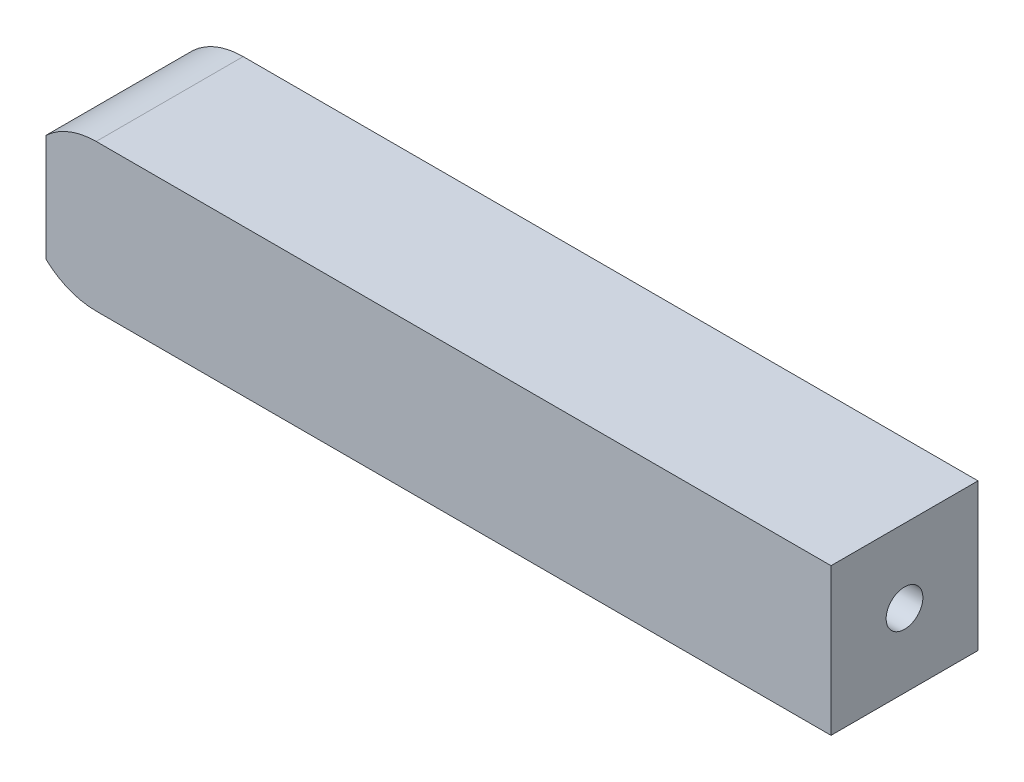
ISO-10303-21;
HEADER;
FILE_DESCRIPTION(('STEP AP214'),'2;1');
FILE_NAME('part.step','',(''),(''),'','','');
FILE_SCHEMA(('AUTOMOTIVE_DESIGN { 1 0 10303 214 1 1 1 1 }'));
ENDSEC;
DATA;
#1=APPLICATION_CONTEXT('core data for automotive mechanical design processes');
#2=APPLICATION_PROTOCOL_DEFINITION('international standard','automotive_design',2000,#1);
#3=PRODUCT_CONTEXT('',#1,'mechanical');
#4=PRODUCT('Part','Part','',(#3));
#5=PRODUCT_RELATED_PRODUCT_CATEGORY('part','',(#4));
#6=PRODUCT_DEFINITION_FORMATION('','',#4);
#7=PRODUCT_DEFINITION_CONTEXT('part definition',#1,'design');
#8=PRODUCT_DEFINITION('design','',#6,#7);
#9=PRODUCT_DEFINITION_SHAPE('','',#8);
#10=(LENGTH_UNIT() NAMED_UNIT(*) SI_UNIT(.MILLI.,.METRE.));
#11=(NAMED_UNIT(*) PLANE_ANGLE_UNIT() SI_UNIT($,.RADIAN.));
#12=(NAMED_UNIT(*) SI_UNIT($,.STERADIAN.) SOLID_ANGLE_UNIT());
#13=UNCERTAINTY_MEASURE_WITH_UNIT(LENGTH_MEASURE(1.E-05),#10,'distance_accuracy_value','');
#14=(GEOMETRIC_REPRESENTATION_CONTEXT(3) GLOBAL_UNCERTAINTY_ASSIGNED_CONTEXT((#13)) GLOBAL_UNIT_ASSIGNED_CONTEXT((#10,
#11,#12)) REPRESENTATION_CONTEXT('',''));
#15=CARTESIAN_POINT('',(0.,0.,0.));
#16=DIRECTION('',(0.,0.,1.));
#17=DIRECTION('',(1.,0.,0.));
#18=AXIS2_PLACEMENT_3D('',#15,#16,#17);
#19=CARTESIAN_POINT('',(0.,0.,-4.));
#20=DIRECTION('',(0.,0.,1.));
#21=DIRECTION('',(-1.,0.,0.));
#22=AXIS2_PLACEMENT_3D('',#19,#20,#21);
#23=CYLINDRICAL_SURFACE('',#22,2.);
#24=DIRECTION('',(0.,0.,-1.));
#25=VECTOR('',#24,1.);
#26=CARTESIAN_POINT('',(-1.36602540378444,-1.46081299152751,-1.));
#27=LINE('',#26,#25);
#28=CARTESIAN_POINT('',(-1.36602540378444,-1.46081299152751,0.));
#29=VERTEX_POINT('',#28);
#30=CARTESIAN_POINT('',(-1.36602540378444,-1.46081299152751,-4.));
#31=VERTEX_POINT('',#30);
#32=EDGE_CURVE('E213',#29,#31,#27,.T.);
#33=ORIENTED_EDGE('',*,*,#32,.T.);
#34=CARTESIAN_POINT('',(0.,0.,-4.));
#35=DIRECTION('',(0.,0.,1.));
#36=DIRECTION('',(1.,0.,0.));
#37=AXIS2_PLACEMENT_3D('',#34,#35,#36);
#38=CIRCLE('',#37,2.);
#39=CARTESIAN_POINT('',(0.,-2.,-4.));
#40=VERTEX_POINT('',#39);
#41=EDGE_CURVE('E248',#31,#40,#38,.T.);
#42=ORIENTED_EDGE('',*,*,#41,.T.);
#43=DIRECTION('',(0.,0.,1.));
#44=VECTOR('',#43,1.);
#45=CARTESIAN_POINT('',(0.,-2.,-4.));
#46=LINE('',#45,#44);
#47=CARTESIAN_POINT('',(0.,-2.,0.));
#48=VERTEX_POINT('',#47);
#49=EDGE_CURVE('E274',#40,#48,#46,.T.);
#50=ORIENTED_EDGE('',*,*,#49,.T.);
#51=CARTESIAN_POINT('',(0.,0.,0.));
#52=DIRECTION('',(0.,0.,1.));
#53=DIRECTION('',(1.,0.,0.));
#54=AXIS2_PLACEMENT_3D('',#51,#52,#53);
#55=CIRCLE('',#54,2.);
#56=EDGE_CURVE('E262',#29,#48,#55,.T.);
#57=ORIENTED_EDGE('',*,*,#56,.F.);
#58=EDGE_LOOP('',(#33,#42,#50,#57));
#59=FACE_BOUND('',#58,.T.);
#60=ADVANCED_FACE('F39',(#59),#23,.T.);
#61=CARTESIAN_POINT('',(0.,2.,-4.));
#62=DIRECTION('',(0.,-1.,0.));
#63=DIRECTION('',(0.,0.,1.));
#64=AXIS2_PLACEMENT_3D('',#61,#62,#63);
#65=PLANE('',#64);
#66=DIRECTION('',(-1.,0.,0.));
#67=VECTOR('',#66,1.);
#68=CARTESIAN_POINT('',(0.,2.,0.));
#69=LINE('',#68,#67);
#70=CARTESIAN_POINT('',(20.,2.,0.));
#71=VERTEX_POINT('',#70);
#72=CARTESIAN_POINT('',(0.,2.,0.));
#73=VERTEX_POINT('',#72);
#74=EDGE_CURVE('E242',#71,#73,#69,.T.);
#75=ORIENTED_EDGE('',*,*,#74,.F.);
#76=DIRECTION('',(0.,0.,1.));
#77=VECTOR('',#76,1.);
#78=CARTESIAN_POINT('',(20.,2.,-4.));
#79=LINE('',#78,#77);
#80=CARTESIAN_POINT('',(20.,2.,-4.));
#81=VERTEX_POINT('',#80);
#82=EDGE_CURVE('E259',#81,#71,#79,.T.);
#83=ORIENTED_EDGE('',*,*,#82,.F.);
#84=DIRECTION('',(-1.,0.,0.));
#85=VECTOR('',#84,1.);
#86=CARTESIAN_POINT('',(0.,2.,-4.));
#87=LINE('',#86,#85);
#88=CARTESIAN_POINT('',(0.,2.,-4.));
#89=VERTEX_POINT('',#88);
#90=EDGE_CURVE('E245',#81,#89,#87,.T.);
#91=ORIENTED_EDGE('',*,*,#90,.T.);
#92=DIRECTION('',(0.,0.,1.));
#93=VECTOR('',#92,1.);
#94=CARTESIAN_POINT('',(0.,2.,-4.));
#95=LINE('',#94,#93);
#96=EDGE_CURVE('E47',#89,#73,#95,.T.);
#97=ORIENTED_EDGE('',*,*,#96,.T.);
#98=EDGE_LOOP('',(#75,#83,#91,#97));
#99=FACE_BOUND('',#98,.T.);
#100=ADVANCED_FACE('F41',(#99),#65,.F.);
#101=CARTESIAN_POINT('',(-1.36602540378444,1.46081299152751,0.));
#102=VERTEX_POINT('',#101);
#103=EDGE_CURVE('E263',#73,#102,#55,.T.);
#104=ORIENTED_EDGE('',*,*,#103,.F.);
#105=ORIENTED_EDGE('',*,*,#96,.F.);
#106=CARTESIAN_POINT('',(-1.36602540378444,1.46081299152751,-4.));
#107=VERTEX_POINT('',#106);
#108=EDGE_CURVE('E250',#89,#107,#38,.T.);
#109=ORIENTED_EDGE('',*,*,#108,.T.);
#110=DIRECTION('',(0.,0.,-1.));
#111=VECTOR('',#110,1.);
#112=CARTESIAN_POINT('',(-1.36602540378444,1.46081299152751,-1.));
#113=LINE('',#112,#111);
#114=EDGE_CURVE('E225',#102,#107,#113,.T.);
#115=ORIENTED_EDGE('',*,*,#114,.F.);
#116=EDGE_LOOP('',(#104,#105,#109,#115));
#117=FACE_BOUND('',#116,.T.);
#118=ADVANCED_FACE('F295',(#117),#23,.T.);
#119=CARTESIAN_POINT('',(0.,-2.,-4.));
#120=DIRECTION('',(0.,-1.,0.));
#121=DIRECTION('',(0.,0.,1.));
#122=AXIS2_PLACEMENT_3D('',#119,#120,#121);
#123=PLANE('',#122);
#124=DIRECTION('',(0.,0.,-1.));
#125=VECTOR('',#124,1.);
#126=CARTESIAN_POINT('',(11.6190832105267,-2.,-1.));
#127=LINE('',#126,#125);
#128=CARTESIAN_POINT('',(11.6190832105267,-2.,-1.));
#129=VERTEX_POINT('',#128);
#130=CARTESIAN_POINT('',(11.6190832105267,-2.,-4.));
#131=VERTEX_POINT('',#130);
#132=EDGE_CURVE('E198',#129,#131,#127,.T.);
#133=ORIENTED_EDGE('',*,*,#132,.T.);
#134=DIRECTION('',(-1.,0.,0.));
#135=VECTOR('',#134,1.);
#136=CARTESIAN_POINT('',(0.,-2.,-4.));
#137=LINE('',#136,#135);
#138=CARTESIAN_POINT('',(20.,-2.,-4.));
#139=VERTEX_POINT('',#138);
#140=EDGE_CURVE('E254',#139,#131,#137,.T.);
#141=ORIENTED_EDGE('',*,*,#140,.F.);
#142=DIRECTION('',(0.,0.,1.));
#143=VECTOR('',#142,1.);
#144=CARTESIAN_POINT('',(20.,-2.,-4.));
#145=LINE('',#144,#143);
#146=CARTESIAN_POINT('',(20.,-2.,0.));
#147=VERTEX_POINT('',#146);
#148=EDGE_CURVE('E271',#139,#147,#145,.T.);
#149=ORIENTED_EDGE('',*,*,#148,.T.);
#150=DIRECTION('',(-1.,0.,0.));
#151=VECTOR('',#150,1.);
#152=CARTESIAN_POINT('',(0.,-2.,0.));
#153=LINE('',#152,#151);
#154=EDGE_CURVE('E266',#147,#48,#153,.T.);
#155=ORIENTED_EDGE('',*,*,#154,.T.);
#156=ORIENTED_EDGE('',*,*,#49,.F.);
#157=CARTESIAN_POINT('',(8.82827307928189,-2.,-4.));
#158=VERTEX_POINT('',#157);
#159=EDGE_CURVE('E253',#158,#40,#137,.T.);
#160=ORIENTED_EDGE('',*,*,#159,.F.);
#161=DIRECTION('',(0.,0.,-1.));
#162=VECTOR('',#161,1.);
#163=CARTESIAN_POINT('',(8.82827307928189,-2.,-1.));
#164=LINE('',#163,#162);
#165=CARTESIAN_POINT('',(8.82827307928189,-2.,-1.));
#166=VERTEX_POINT('',#165);
#167=EDGE_CURVE('E201',#166,#158,#164,.T.);
#168=ORIENTED_EDGE('',*,*,#167,.F.);
#169=DIRECTION('',(1.,0.,0.));
#170=VECTOR('',#169,1.);
#171=CARTESIAN_POINT('',(9.91748930079195,-2.,-1.));
#172=LINE('',#171,#170);
#173=EDGE_CURVE('E181',#166,#129,#172,.T.);
#174=ORIENTED_EDGE('',*,*,#173,.T.);
#175=EDGE_LOOP('',(#133,#141,#149,#155,#156,#160,#168,#174));
#176=FACE_BOUND('',#175,.T.);
#177=ADVANCED_FACE('F304',(#176),#123,.T.);
#178=CARTESIAN_POINT('',(20.,0.,-4.));
#179=DIRECTION('',(-1.,0.,0.));
#180=DIRECTION('',(0.,0.,-1.));
#181=AXIS2_PLACEMENT_3D('',#178,#179,#180);
#182=PLANE('',#181);
#183=CARTESIAN_POINT('',(20.,0.,-2.00000000000477));
#184=DIRECTION('',(-1.,0.,0.));
#185=DIRECTION('',(0.,0.,1.));
#186=AXIS2_PLACEMENT_3D('',#183,#184,#185);
#187=CIRCLE('',#186,0.5);
#188=CARTESIAN_POINT('',(20.,0.,-1.50000000000477));
#189=VERTEX_POINT('',#188);
#190=EDGE_CURVE('E228',#189,#189,#187,.T.);
#191=ORIENTED_EDGE('',*,*,#190,.T.);
#192=EDGE_LOOP('',(#191));
#193=FACE_BOUND('',#192,.T.);
#194=DIRECTION('',(0.,1.,0.));
#195=VECTOR('',#194,1.);
#196=CARTESIAN_POINT('',(20.,0.,0.));
#197=LINE('',#196,#195);
#198=EDGE_CURVE('E249',#147,#71,#197,.T.);
#199=ORIENTED_EDGE('',*,*,#198,.F.);
#200=ORIENTED_EDGE('',*,*,#148,.F.);
#201=DIRECTION('',(0.,1.,0.));
#202=VECTOR('',#201,1.);
#203=CARTESIAN_POINT('',(20.,0.,-4.));
#204=LINE('',#203,#202);
#205=EDGE_CURVE('E257',#139,#81,#204,.T.);
#206=ORIENTED_EDGE('',*,*,#205,.T.);
#207=ORIENTED_EDGE('',*,*,#82,.T.);
#208=EDGE_LOOP('',(#199,#200,#206,#207));
#209=FACE_BOUND('',#208,.T.);
#210=ADVANCED_FACE('F289',(#193,#209),#182,.F.);
#211=CARTESIAN_POINT('',(0.,0.,-4.));
#212=DIRECTION('',(0.,0.,-1.));
#213=DIRECTION('',(1.,0.,0.));
#214=AXIS2_PLACEMENT_3D('',#211,#212,#213);
#215=PLANE('',#214);
#216=CARTESIAN_POINT('',(10.2236781449043,-2.55031327699351,-4.));
#217=DIRECTION('',(0.,0.,1.));
#218=DIRECTION('',(1.,0.,0.));
#219=AXIS2_PLACEMENT_3D('',#216,#217,#218);
#220=CIRCLE('',#219,1.5);
#221=CARTESIAN_POINT('',(11.2454634200098,-1.45215352013772,-4.));
#222=VERTEX_POINT('',#221);
#223=EDGE_CURVE('E177',#131,#222,#220,.T.);
#224=ORIENTED_EDGE('',*,*,#223,.T.);
#225=DIRECTION('',(0.398196762426413,0.917300026378024,0.));
#226=VECTOR('',#225,1.);
#227=CARTESIAN_POINT('',(11.444561801223,-0.993503506948711,-4.));
#228=LINE('',#227,#226);
#229=CARTESIAN_POINT('',(11.444561801223,-0.993503506948711,-4.));
#230=VERTEX_POINT('',#229);
#231=EDGE_CURVE('E174',#222,#230,#228,.T.);
#232=ORIENTED_EDGE('',*,*,#231,.T.);
#233=CARTESIAN_POINT('',(11.3307603,0.,-4.));
#234=DIRECTION('',(0.,0.,1.));
#235=DIRECTION('',(1.,0.,0.));
#236=AXIS2_PLACEMENT_3D('',#233,#234,#235);
#237=CIRCLE('',#236,1.);
#238=CARTESIAN_POINT('',(10.527261774845,-0.595306744522293,-4.));
#239=VERTEX_POINT('',#238);
#240=EDGE_CURVE('E187',#230,#239,#237,.T.);
#241=ORIENTED_EDGE('',*,*,#240,.T.);
#242=DIRECTION('',(-0.398196762426417,-0.917300026378022,0.));
#243=VECTOR('',#242,1.);
#244=CARTESIAN_POINT('',(10.527261774845,-0.595306744522293,-4.));
#245=LINE('',#244,#243);
#246=CARTESIAN_POINT('',(10.3281633936318,-1.0539567577113,-4.));
#247=VERTEX_POINT('',#246);
#248=EDGE_CURVE('E167',#239,#247,#245,.T.);
#249=ORIENTED_EDGE('',*,*,#248,.T.);
#250=CARTESIAN_POINT('',(10.2236781449043,-2.55031327699351,-4.));
#251=DIRECTION('',(0.,0.,1.));
#252=DIRECTION('',(1.,0.,0.));
#253=AXIS2_PLACEMENT_3D('',#250,#251,#252);
#254=CIRCLE('',#253,1.5);
#255=EDGE_CURVE('E190',#247,#158,#254,.T.);
#256=ORIENTED_EDGE('',*,*,#255,.T.);
#257=ORIENTED_EDGE('',*,*,#159,.T.);
#258=ORIENTED_EDGE('',*,*,#41,.F.);
#259=DIRECTION('',(0.,-1.,0.));
#260=VECTOR('',#259,1.);
#261=CARTESIAN_POINT('',(-1.36602540378444,0.,-4.));
#262=LINE('',#261,#260);
#263=CARTESIAN_POINT('',(-1.36602540378444,-0.5,-4.));
#264=VERTEX_POINT('',#263);
#265=EDGE_CURVE('E62',#264,#31,#262,.T.);
#266=ORIENTED_EDGE('',*,*,#265,.F.);
#267=DIRECTION('',(-1.,0.,0.));
#268=VECTOR('',#267,1.);
#269=CARTESIAN_POINT('',(0.,-0.5,-4.));
#270=LINE('',#269,#268);
#271=CARTESIAN_POINT('',(-0.866025403784438,-0.5,-4.));
#272=VERTEX_POINT('',#271);
#273=EDGE_CURVE('E215',#272,#264,#270,.T.);
#274=ORIENTED_EDGE('',*,*,#273,.F.);
#275=CARTESIAN_POINT('',(0.,0.,-4.));
#276=DIRECTION('',(0.,0.,1.));
#277=DIRECTION('',(1.,0.,0.));
#278=AXIS2_PLACEMENT_3D('',#275,#276,#277);
#279=CIRCLE('',#278,1.);
#280=CARTESIAN_POINT('',(-0.866025403784438,0.5,-4.));
#281=VERTEX_POINT('',#280);
#282=EDGE_CURVE('E218',#272,#281,#279,.T.);
#283=ORIENTED_EDGE('',*,*,#282,.T.);
#284=DIRECTION('',(-1.,0.,0.));
#285=VECTOR('',#284,1.);
#286=CARTESIAN_POINT('',(0.,0.5,-4.));
#287=LINE('',#286,#285);
#288=CARTESIAN_POINT('',(-1.36602540378444,0.5,-4.));
#289=VERTEX_POINT('',#288);
#290=EDGE_CURVE('E221',#281,#289,#287,.T.);
#291=ORIENTED_EDGE('',*,*,#290,.T.);
#292=DIRECTION('',(0.,1.,0.));
#293=VECTOR('',#292,1.);
#294=CARTESIAN_POINT('',(-1.36602540378444,0.,-4.));
#295=LINE('',#294,#293);
#296=EDGE_CURVE('E209',#289,#107,#295,.T.);
#297=ORIENTED_EDGE('',*,*,#296,.T.);
#298=ORIENTED_EDGE('',*,*,#108,.F.);
#299=ORIENTED_EDGE('',*,*,#90,.F.);
#300=ORIENTED_EDGE('',*,*,#205,.F.);
#301=ORIENTED_EDGE('',*,*,#140,.T.);
#302=EDGE_LOOP('',(#224,#232,#241,#249,#256,#257,#258,#266,#274,#283,#291,#297,#298,#299,#300,#301));
#303=FACE_BOUND('',#302,.T.);
#304=ADVANCED_FACE('F292',(#303),#215,.T.);
#305=CARTESIAN_POINT('',(0.,0.,0.));
#306=DIRECTION('',(0.,0.,-1.));
#307=DIRECTION('',(1.,0.,0.));
#308=AXIS2_PLACEMENT_3D('',#305,#306,#307);
#309=PLANE('',#308);
#310=ORIENTED_EDGE('',*,*,#56,.T.);
#311=ORIENTED_EDGE('',*,*,#154,.F.);
#312=ORIENTED_EDGE('',*,*,#198,.T.);
#313=ORIENTED_EDGE('',*,*,#74,.T.);
#314=ORIENTED_EDGE('',*,*,#103,.T.);
#315=DIRECTION('',(0.,1.,0.));
#316=VECTOR('',#315,1.);
#317=CARTESIAN_POINT('',(-1.36602540378444,0.,0.));
#318=LINE('',#317,#316);
#319=EDGE_CURVE('E195',#29,#102,#318,.T.);
#320=ORIENTED_EDGE('',*,*,#319,.F.);
#321=EDGE_LOOP('',(#310,#311,#312,#313,#314,#320));
#322=FACE_BOUND('',#321,.T.);
#323=ADVANCED_FACE('F285',(#322),#309,.F.);
#324=CARTESIAN_POINT('',(13.,0.,-2.00000000000477));
#325=DIRECTION('',(1.,0.,0.));
#326=DIRECTION('',(0.,0.,1.));
#327=AXIS2_PLACEMENT_3D('',#324,#325,#326);
#328=CYLINDRICAL_SURFACE('',#327,0.5);
#329=CARTESIAN_POINT('',(13.,0.,-2.00000000000477));
#330=DIRECTION('',(-1.,0.,0.));
#331=DIRECTION('',(0.,0.,1.));
#332=AXIS2_PLACEMENT_3D('',#329,#330,#331);
#333=CIRCLE('',#332,0.5);
#334=CARTESIAN_POINT('',(13.,0.,-1.50000000000477));
#335=VERTEX_POINT('',#334);
#336=EDGE_CURVE('E239',#335,#335,#333,.T.);
#337=ORIENTED_EDGE('',*,*,#336,.T.);
#338=EDGE_LOOP('',(#337));
#339=FACE_BOUND('',#338,.T.);
#340=ORIENTED_EDGE('',*,*,#190,.F.);
#341=EDGE_LOOP('',(#340));
#342=FACE_BOUND('',#341,.T.);
#343=ADVANCED_FACE('F341',(#339,#342),#328,.F.);
#344=CARTESIAN_POINT('',(13.,0.,-2.00000000000477));
#345=DIRECTION('',(1.,0.,0.));
#346=DIRECTION('',(0.,0.,1.));
#347=AXIS2_PLACEMENT_3D('',#344,#345,#346);
#348=PLANE('',#347);
#349=ORIENTED_EDGE('',*,*,#336,.F.);
#350=EDGE_LOOP('',(#349));
#351=FACE_BOUND('',#350,.T.);
#352=ADVANCED_FACE('F346',(#351),#348,.T.);
#353=CARTESIAN_POINT('',(-1.36602540378444,0.,-1.));
#354=DIRECTION('',(1.,0.,0.));
#355=DIRECTION('',(0.,0.,1.));
#356=AXIS2_PLACEMENT_3D('',#353,#354,#355);
#357=PLANE('',#356);
#358=ORIENTED_EDGE('',*,*,#296,.F.);
#359=DIRECTION('',(0.,0.,-1.));
#360=VECTOR('',#359,1.);
#361=CARTESIAN_POINT('',(-1.36602540378444,0.5,-1.));
#362=LINE('',#361,#360);
#363=CARTESIAN_POINT('',(-1.36602540378444,0.5,-1.));
#364=VERTEX_POINT('',#363);
#365=EDGE_CURVE('E229',#364,#289,#362,.T.);
#366=ORIENTED_EDGE('',*,*,#365,.F.);
#367=DIRECTION('',(0.,1.,0.));
#368=VECTOR('',#367,1.);
#369=CARTESIAN_POINT('',(-1.36602540378444,0.,-1.));
#370=LINE('',#369,#368);
#371=CARTESIAN_POINT('',(-1.36602540378444,-0.5,-1.));
#372=VERTEX_POINT('',#371);
#373=EDGE_CURVE('E11',#372,#364,#370,.T.);
#374=ORIENTED_EDGE('',*,*,#373,.F.);
#375=DIRECTION('',(0.,0.,-1.));
#376=VECTOR('',#375,1.);
#377=CARTESIAN_POINT('',(-1.36602540378444,-0.5,-1.));
#378=LINE('',#377,#376);
#379=EDGE_CURVE('E235',#372,#264,#378,.T.);
#380=ORIENTED_EDGE('',*,*,#379,.T.);
#381=ORIENTED_EDGE('',*,*,#265,.T.);
#382=ORIENTED_EDGE('',*,*,#32,.F.);
#383=ORIENTED_EDGE('',*,*,#319,.T.);
#384=ORIENTED_EDGE('',*,*,#114,.T.);
#385=EDGE_LOOP('',(#358,#366,#374,#380,#381,#382,#383,#384));
#386=FACE_BOUND('',#385,.T.);
#387=ADVANCED_FACE('F296',(#386),#357,.F.);
#388=CARTESIAN_POINT('',(0.,0.5,-1.));
#389=DIRECTION('',(0.,1.,0.));
#390=DIRECTION('',(-1.,0.,0.));
#391=AXIS2_PLACEMENT_3D('',#388,#389,#390);
#392=PLANE('',#391);
#393=ORIENTED_EDGE('',*,*,#290,.F.);
#394=DIRECTION('',(0.,0.,-1.));
#395=VECTOR('',#394,1.);
#396=CARTESIAN_POINT('',(-0.866025403784438,0.5,-1.));
#397=LINE('',#396,#395);
#398=CARTESIAN_POINT('',(-0.866025403784438,0.5,-1.));
#399=VERTEX_POINT('',#398);
#400=EDGE_CURVE('E231',#399,#281,#397,.T.);
#401=ORIENTED_EDGE('',*,*,#400,.F.);
#402=DIRECTION('',(-1.,0.,0.));
#403=VECTOR('',#402,1.);
#404=CARTESIAN_POINT('',(0.,0.5,-1.));
#405=LINE('',#404,#403);
#406=EDGE_CURVE('E211',#399,#364,#405,.T.);
#407=ORIENTED_EDGE('',*,*,#406,.T.);
#408=ORIENTED_EDGE('',*,*,#365,.T.);
#409=EDGE_LOOP('',(#393,#401,#407,#408));
#410=FACE_BOUND('',#409,.T.);
#411=ADVANCED_FACE('F359',(#410),#392,.F.);
#412=CARTESIAN_POINT('',(0.,0.,-1.));
#413=DIRECTION('',(0.,0.,-1.));
#414=DIRECTION('',(1.,0.,0.));
#415=AXIS2_PLACEMENT_3D('',#412,#413,#414);
#416=CYLINDRICAL_SURFACE('',#415,1.);
#417=ORIENTED_EDGE('',*,*,#282,.F.);
#418=DIRECTION('',(0.,0.,-1.));
#419=VECTOR('',#418,1.);
#420=CARTESIAN_POINT('',(-0.866025403784438,-0.5,-1.));
#421=LINE('',#420,#419);
#422=CARTESIAN_POINT('',(-0.866025403784438,-0.5,-1.));
#423=VERTEX_POINT('',#422);
#424=EDGE_CURVE('E233',#423,#272,#421,.T.);
#425=ORIENTED_EDGE('',*,*,#424,.F.);
#426=CARTESIAN_POINT('',(0.,0.,-1.));
#427=DIRECTION('',(0.,0.,1.));
#428=DIRECTION('',(1.,0.,0.));
#429=AXIS2_PLACEMENT_3D('',#426,#427,#428);
#430=CIRCLE('',#429,1.);
#431=EDGE_CURVE('E208',#423,#399,#430,.T.);
#432=ORIENTED_EDGE('',*,*,#431,.T.);
#433=ORIENTED_EDGE('',*,*,#400,.T.);
#434=EDGE_LOOP('',(#417,#425,#432,#433));
#435=FACE_BOUND('',#434,.T.);
#436=ADVANCED_FACE('F355',(#435),#416,.F.);
#437=CARTESIAN_POINT('',(0.,-0.5,-1.));
#438=DIRECTION('',(0.,1.,0.));
#439=DIRECTION('',(-1.,0.,0.));
#440=AXIS2_PLACEMENT_3D('',#437,#438,#439);
#441=PLANE('',#440);
#442=ORIENTED_EDGE('',*,*,#273,.T.);
#443=ORIENTED_EDGE('',*,*,#379,.F.);
#444=DIRECTION('',(-1.,0.,0.));
#445=VECTOR('',#444,1.);
#446=CARTESIAN_POINT('',(0.,-0.5,-1.));
#447=LINE('',#446,#445);
#448=EDGE_CURVE('E206',#423,#372,#447,.T.);
#449=ORIENTED_EDGE('',*,*,#448,.F.);
#450=ORIENTED_EDGE('',*,*,#424,.T.);
#451=EDGE_LOOP('',(#442,#443,#449,#450));
#452=FACE_BOUND('',#451,.T.);
#453=ADVANCED_FACE('F351',(#452),#441,.T.);
#454=CARTESIAN_POINT('',(0.,0.,-1.));
#455=DIRECTION('',(0.,0.,-1.));
#456=DIRECTION('',(1.,0.,0.));
#457=AXIS2_PLACEMENT_3D('',#454,#455,#456);
#458=PLANE('',#457);
#459=ORIENTED_EDGE('',*,*,#373,.T.);
#460=ORIENTED_EDGE('',*,*,#406,.F.);
#461=ORIENTED_EDGE('',*,*,#431,.F.);
#462=ORIENTED_EDGE('',*,*,#448,.T.);
#463=EDGE_LOOP('',(#459,#460,#461,#462));
#464=FACE_BOUND('',#463,.T.);
#465=ADVANCED_FACE('F354',(#464),#458,.T.);
#466=CARTESIAN_POINT('',(11.3307603,0.,-1.));
#467=DIRECTION('',(0.,0.,-1.));
#468=DIRECTION('',(1.,0.,0.));
#469=AXIS2_PLACEMENT_3D('',#466,#467,#468);
#470=CYLINDRICAL_SURFACE('',#469,1.);
#471=ORIENTED_EDGE('',*,*,#240,.F.);
#472=DIRECTION('',(0.,0.,-1.));
#473=VECTOR('',#472,1.);
#474=CARTESIAN_POINT('',(11.444561801223,-0.993503506948711,-1.));
#475=LINE('',#474,#473);
#476=CARTESIAN_POINT('',(11.444561801223,-0.993503506948711,-1.));
#477=VERTEX_POINT('',#476);
#478=EDGE_CURVE('E173',#477,#230,#475,.T.);
#479=ORIENTED_EDGE('',*,*,#478,.F.);
#480=CARTESIAN_POINT('',(11.3307603,0.,-1.));
#481=DIRECTION('',(0.,0.,1.));
#482=DIRECTION('',(1.,0.,0.));
#483=AXIS2_PLACEMENT_3D('',#480,#481,#482);
#484=CIRCLE('',#483,1.);
#485=CARTESIAN_POINT('',(10.527261774845,-0.595306744522293,-1.));
#486=VERTEX_POINT('',#485);
#487=EDGE_CURVE('E158',#477,#486,#484,.T.);
#488=ORIENTED_EDGE('',*,*,#487,.T.);
#489=DIRECTION('',(0.,0.,-1.));
#490=VECTOR('',#489,1.);
#491=CARTESIAN_POINT('',(10.527261774845,-0.595306744522293,-1.));
#492=LINE('',#491,#490);
#493=EDGE_CURVE('E54',#486,#239,#492,.T.);
#494=ORIENTED_EDGE('',*,*,#493,.T.);
#495=EDGE_LOOP('',(#471,#479,#488,#494));
#496=FACE_BOUND('',#495,.T.);
#497=ADVANCED_FACE('F172',(#496),#470,.F.);
#498=CARTESIAN_POINT('',(11.444561801223,-0.993503506948711,-1.));
#499=DIRECTION('',(0.917300026378024,-0.398196762426413,0.));
#500=DIRECTION('',(0.398196762426413,0.917300026378024,0.));
#501=AXIS2_PLACEMENT_3D('',#498,#499,#500);
#502=PLANE('',#501);
#503=ORIENTED_EDGE('',*,*,#231,.F.);
#504=DIRECTION('',(0.,0.,-1.));
#505=VECTOR('',#504,1.);
#506=CARTESIAN_POINT('',(11.2454634200098,-1.45215352013772,-1.));
#507=LINE('',#506,#505);
#508=CARTESIAN_POINT('',(11.2454634200098,-1.45215352013772,-1.));
#509=VERTEX_POINT('',#508);
#510=EDGE_CURVE('E196',#509,#222,#507,.T.);
#511=ORIENTED_EDGE('',*,*,#510,.F.);
#512=DIRECTION('',(0.398196762426413,0.917300026378024,0.));
#513=VECTOR('',#512,1.);
#514=CARTESIAN_POINT('',(11.444561801223,-0.993503506948711,-1.));
#515=LINE('',#514,#513);
#516=EDGE_CURVE('E170',#509,#477,#515,.T.);
#517=ORIENTED_EDGE('',*,*,#516,.T.);
#518=ORIENTED_EDGE('',*,*,#478,.T.);
#519=EDGE_LOOP('',(#503,#511,#517,#518));
#520=FACE_BOUND('',#519,.T.);
#521=ADVANCED_FACE('F312',(#520),#502,.F.);
#522=CARTESIAN_POINT('',(10.2236781449043,-2.55031327699351,-1.));
#523=DIRECTION('',(0.,0.,-1.));
#524=DIRECTION('',(1.,0.,0.));
#525=AXIS2_PLACEMENT_3D('',#522,#523,#524);
#526=CYLINDRICAL_SURFACE('',#525,1.5);
#527=ORIENTED_EDGE('',*,*,#223,.F.);
#528=ORIENTED_EDGE('',*,*,#132,.F.);
#529=CARTESIAN_POINT('',(10.2236781449043,-2.55031327699351,-1.));
#530=DIRECTION('',(0.,0.,1.));
#531=DIRECTION('',(1.,0.,0.));
#532=AXIS2_PLACEMENT_3D('',#529,#530,#531);
#533=CIRCLE('',#532,1.5);
#534=EDGE_CURVE('E184',#129,#509,#533,.T.);
#535=ORIENTED_EDGE('',*,*,#534,.T.);
#536=ORIENTED_EDGE('',*,*,#510,.T.);
#537=EDGE_LOOP('',(#527,#528,#535,#536));
#538=FACE_BOUND('',#537,.T.);
#539=ADVANCED_FACE('F309',(#538),#526,.F.);
#540=CARTESIAN_POINT('',(10.2236781449043,-2.55031327699351,-1.));
#541=DIRECTION('',(0.,0.,-1.));
#542=DIRECTION('',(1.,0.,0.));
#543=AXIS2_PLACEMENT_3D('',#540,#541,#542);
#544=CYLINDRICAL_SURFACE('',#543,1.5);
#545=ORIENTED_EDGE('',*,*,#255,.F.);
#546=DIRECTION('',(0.,0.,-1.));
#547=VECTOR('',#546,1.);
#548=CARTESIAN_POINT('',(10.3281633936318,-1.0539567577113,-1.));
#549=LINE('',#548,#547);
#550=CARTESIAN_POINT('',(10.3281633936318,-1.0539567577113,-1.));
#551=VERTEX_POINT('',#550);
#552=EDGE_CURVE('E169',#551,#247,#549,.T.);
#553=ORIENTED_EDGE('',*,*,#552,.F.);
#554=CARTESIAN_POINT('',(10.2236781449043,-2.55031327699351,-1.));
#555=DIRECTION('',(0.,0.,1.));
#556=DIRECTION('',(1.,0.,0.));
#557=AXIS2_PLACEMENT_3D('',#554,#555,#556);
#558=CIRCLE('',#557,1.5);
#559=EDGE_CURVE('E161',#551,#166,#558,.T.);
#560=ORIENTED_EDGE('',*,*,#559,.T.);
#561=ORIENTED_EDGE('',*,*,#167,.T.);
#562=EDGE_LOOP('',(#545,#553,#560,#561));
#563=FACE_BOUND('',#562,.T.);
#564=ADVANCED_FACE('F315',(#563),#544,.F.);
#565=CARTESIAN_POINT('',(10.527261774845,-0.595306744522293,-1.));
#566=DIRECTION('',(-0.917300026378022,0.398196762426417,0.));
#567=DIRECTION('',(-0.398196762426417,-0.917300026378022,0.));
#568=AXIS2_PLACEMENT_3D('',#565,#566,#567);
#569=PLANE('',#568);
#570=ORIENTED_EDGE('',*,*,#248,.F.);
#571=ORIENTED_EDGE('',*,*,#493,.F.);
#572=DIRECTION('',(-0.398196762426417,-0.917300026378022,0.));
#573=VECTOR('',#572,1.);
#574=CARTESIAN_POINT('',(10.527261774845,-0.595306744522293,-1.));
#575=LINE('',#574,#573);
#576=EDGE_CURVE('E155',#486,#551,#575,.T.);
#577=ORIENTED_EDGE('',*,*,#576,.T.);
#578=ORIENTED_EDGE('',*,*,#552,.T.);
#579=EDGE_LOOP('',(#570,#571,#577,#578));
#580=FACE_BOUND('',#579,.T.);
#581=ADVANCED_FACE('F165',(#580),#569,.F.);
#582=CARTESIAN_POINT('',(11.3307603,0.,-1.));
#583=DIRECTION('',(0.,0.,-1.));
#584=DIRECTION('',(1.,0.,0.));
#585=AXIS2_PLACEMENT_3D('',#582,#583,#584);
#586=PLANE('',#585);
#587=ORIENTED_EDGE('',*,*,#487,.F.);
#588=ORIENTED_EDGE('',*,*,#516,.F.);
#589=ORIENTED_EDGE('',*,*,#534,.F.);
#590=ORIENTED_EDGE('',*,*,#173,.F.);
#591=ORIENTED_EDGE('',*,*,#559,.F.);
#592=ORIENTED_EDGE('',*,*,#576,.F.);
#593=EDGE_LOOP('',(#587,#588,#589,#590,#591,#592));
#594=FACE_BOUND('',#593,.T.);
#595=ADVANCED_FACE('F156',(#594),#586,.T.);
#596=CLOSED_SHELL('',(#60,#100,#118,#177,#210,#304,#323,#343,#352,#387,#411,#436,#453,#465,#497,
#521,#539,#564,#581,#595));
#597=MANIFOLD_SOLID_BREP('B2',#596);
#598=ADVANCED_BREP_SHAPE_REPRESENTATION('',(#18,#597),#14);
#599=SHAPE_DEFINITION_REPRESENTATION(#9,#598);
ENDSEC;
END-ISO-10303-21;
